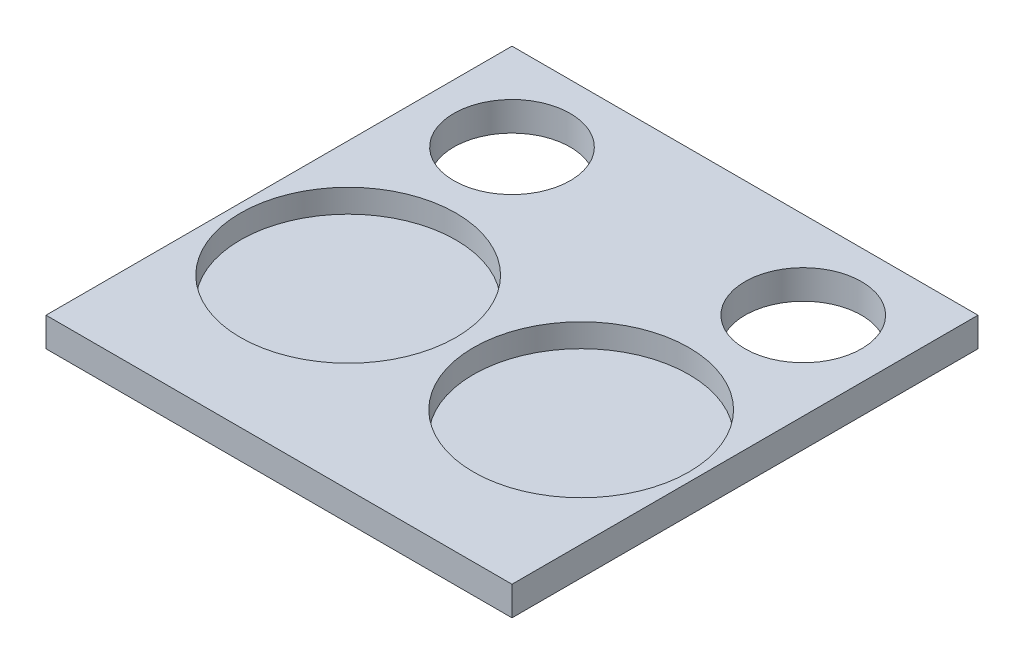
ISO-10303-21;
HEADER;
FILE_DESCRIPTION(('STEP AP214'),'2;1');
FILE_NAME('part.step','',(''),(''),'','','');
FILE_SCHEMA(('AUTOMOTIVE_DESIGN { 1 0 10303 214 1 1 1 1 }'));
ENDSEC;
DATA;
#1=APPLICATION_CONTEXT('core data for automotive mechanical design processes');
#2=APPLICATION_PROTOCOL_DEFINITION('international standard','automotive_design',2000,#1);
#3=PRODUCT_CONTEXT('',#1,'mechanical');
#4=PRODUCT('Part','Part','',(#3));
#5=PRODUCT_RELATED_PRODUCT_CATEGORY('part','',(#4));
#6=PRODUCT_DEFINITION_FORMATION('','',#4);
#7=PRODUCT_DEFINITION_CONTEXT('part definition',#1,'design');
#8=PRODUCT_DEFINITION('design','',#6,#7);
#9=PRODUCT_DEFINITION_SHAPE('','',#8);
#10=(LENGTH_UNIT() NAMED_UNIT(*) SI_UNIT(.MILLI.,.METRE.));
#11=(NAMED_UNIT(*) PLANE_ANGLE_UNIT() SI_UNIT($,.RADIAN.));
#12=(NAMED_UNIT(*) SI_UNIT($,.STERADIAN.) SOLID_ANGLE_UNIT());
#13=UNCERTAINTY_MEASURE_WITH_UNIT(LENGTH_MEASURE(1.E-05),#10,'distance_accuracy_value','');
#14=(GEOMETRIC_REPRESENTATION_CONTEXT(3) GLOBAL_UNCERTAINTY_ASSIGNED_CONTEXT((#13)) GLOBAL_UNIT_ASSIGNED_CONTEXT((#10,
#11,#12)) REPRESENTATION_CONTEXT('',''));
#15=CARTESIAN_POINT('',(0.,0.,0.));
#16=DIRECTION('',(0.,0.,1.));
#17=DIRECTION('',(1.,0.,0.));
#18=AXIS2_PLACEMENT_3D('',#15,#16,#17);
#19=CARTESIAN_POINT('',(0.,3.175,0.));
#20=DIRECTION('',(0.,-1.,0.));
#21=DIRECTION('',(0.,0.,-1.));
#22=AXIS2_PLACEMENT_3D('',#19,#20,#21);
#23=PLANE('',#22);
#24=CARTESIAN_POINT('',(-25.4,3.175,10.3184504706318));
#25=DIRECTION('',(0.,1.,0.));
#26=DIRECTION('',(0.,0.,1.));
#27=AXIS2_PLACEMENT_3D('',#24,#25,#26);
#28=CIRCLE('',#27,23.495);
#29=CARTESIAN_POINT('',(-25.4,3.175,33.8134504706318));
#30=VERTEX_POINT('',#29);
#31=EDGE_CURVE('E130',#30,#30,#28,.T.);
#32=ORIENTED_EDGE('',*,*,#31,.F.);
#33=EDGE_LOOP('',(#32));
#34=FACE_BOUND('',#33,.T.);
#35=CARTESIAN_POINT('',(25.4,3.175,10.3184504706318));
#36=DIRECTION('',(0.,1.,0.));
#37=DIRECTION('',(0.,0.,1.));
#38=AXIS2_PLACEMENT_3D('',#35,#36,#37);
#39=CIRCLE('',#38,23.495);
#40=CARTESIAN_POINT('',(25.4,3.175,33.8134504706318));
#41=VERTEX_POINT('',#40);
#42=EDGE_CURVE('E124',#41,#41,#39,.T.);
#43=ORIENTED_EDGE('',*,*,#42,.F.);
#44=EDGE_LOOP('',(#43));
#45=FACE_BOUND('',#44,.T.);
#46=DIRECTION('',(0.,0.,-1.));
#47=VECTOR('',#46,1.);
#48=CARTESIAN_POINT('',(50.8,3.175,50.8));
#49=LINE('',#48,#47);
#50=CARTESIAN_POINT('',(50.8,3.175,50.8));
#51=VERTEX_POINT('',#50);
#52=CARTESIAN_POINT('',(50.8,3.175,-50.8));
#53=VERTEX_POINT('',#52);
#54=EDGE_CURVE('E85',#51,#53,#49,.T.);
#55=ORIENTED_EDGE('',*,*,#54,.T.);
#56=DIRECTION('',(-1.,0.,0.));
#57=VECTOR('',#56,1.);
#58=CARTESIAN_POINT('',(-50.8,3.175,-50.8));
#59=LINE('',#58,#57);
#60=CARTESIAN_POINT('',(-50.8,3.175,-50.8));
#61=VERTEX_POINT('',#60);
#62=EDGE_CURVE('E80',#53,#61,#59,.T.);
#63=ORIENTED_EDGE('',*,*,#62,.T.);
#64=DIRECTION('',(0.,0.,1.));
#65=VECTOR('',#64,1.);
#66=CARTESIAN_POINT('',(-50.8,3.175,50.8));
#67=LINE('',#66,#65);
#68=CARTESIAN_POINT('',(-50.8,3.175,50.8));
#69=VERTEX_POINT('',#68);
#70=EDGE_CURVE('E83',#61,#69,#67,.T.);
#71=ORIENTED_EDGE('',*,*,#70,.T.);
#72=DIRECTION('',(1.,0.,0.));
#73=VECTOR('',#72,1.);
#74=CARTESIAN_POINT('',(-50.8,3.175,50.8));
#75=LINE('',#74,#73);
#76=EDGE_CURVE('E50',#69,#51,#75,.T.);
#77=ORIENTED_EDGE('',*,*,#76,.T.);
#78=EDGE_LOOP('',(#55,#63,#71,#77));
#79=FACE_BOUND('',#78,.T.);
#80=CARTESIAN_POINT('',(-31.75,3.175,-31.75));
#81=DIRECTION('',(0.,1.,0.));
#82=DIRECTION('',(0.,0.,1.));
#83=AXIS2_PLACEMENT_3D('',#80,#81,#82);
#84=CIRCLE('',#83,12.7);
#85=CARTESIAN_POINT('',(-31.75,3.175,-19.05));
#86=VERTEX_POINT('',#85);
#87=EDGE_CURVE('E100',#86,#86,#84,.T.);
#88=ORIENTED_EDGE('',*,*,#87,.F.);
#89=EDGE_LOOP('',(#88));
#90=FACE_BOUND('',#89,.T.);
#91=CARTESIAN_POINT('',(31.75,3.175,-31.75));
#92=DIRECTION('',(0.,1.,0.));
#93=DIRECTION('',(0.,0.,1.));
#94=AXIS2_PLACEMENT_3D('',#91,#92,#93);
#95=CIRCLE('',#94,12.7);
#96=CARTESIAN_POINT('',(31.75,3.175,-19.05));
#97=VERTEX_POINT('',#96);
#98=EDGE_CURVE('E115',#97,#97,#95,.T.);
#99=ORIENTED_EDGE('',*,*,#98,.F.);
#100=EDGE_LOOP('',(#99));
#101=FACE_BOUND('',#100,.T.);
#102=ADVANCED_FACE('F33',(#34,#45,#79,#90,#101),#23,.F.);
#103=CARTESIAN_POINT('',(0.,-3.175,0.));
#104=DIRECTION('',(0.,-1.,0.));
#105=DIRECTION('',(0.,0.,-1.));
#106=AXIS2_PLACEMENT_3D('',#103,#104,#105);
#107=PLANE('',#106);
#108=CARTESIAN_POINT('',(-31.75,-3.175,-31.75));
#109=DIRECTION('',(0.,1.,0.));
#110=DIRECTION('',(0.,0.,1.));
#111=AXIS2_PLACEMENT_3D('',#108,#109,#110);
#112=CIRCLE('',#111,12.7);
#113=CARTESIAN_POINT('',(-31.75,-3.175,-19.05));
#114=VERTEX_POINT('',#113);
#115=EDGE_CURVE('E112',#114,#114,#112,.T.);
#116=ORIENTED_EDGE('',*,*,#115,.T.);
#117=EDGE_LOOP('',(#116));
#118=FACE_BOUND('',#117,.T.);
#119=DIRECTION('',(0.,0.,-1.));
#120=VECTOR('',#119,1.);
#121=CARTESIAN_POINT('',(50.8,-3.175,50.8));
#122=LINE('',#121,#120);
#123=CARTESIAN_POINT('',(50.8,-3.175,50.8));
#124=VERTEX_POINT('',#123);
#125=CARTESIAN_POINT('',(50.8,-3.175,-50.8));
#126=VERTEX_POINT('',#125);
#127=EDGE_CURVE('E97',#124,#126,#122,.T.);
#128=ORIENTED_EDGE('',*,*,#127,.F.);
#129=DIRECTION('',(1.,0.,0.));
#130=VECTOR('',#129,1.);
#131=CARTESIAN_POINT('',(-50.8,-3.175,50.8));
#132=LINE('',#131,#130);
#133=CARTESIAN_POINT('',(-50.8,-3.175,50.8));
#134=VERTEX_POINT('',#133);
#135=EDGE_CURVE('E73',#134,#124,#132,.T.);
#136=ORIENTED_EDGE('',*,*,#135,.F.);
#137=DIRECTION('',(0.,0.,1.));
#138=VECTOR('',#137,1.);
#139=CARTESIAN_POINT('',(-50.8,-3.175,50.8));
#140=LINE('',#139,#138);
#141=CARTESIAN_POINT('',(-50.8,-3.175,-50.8));
#142=VERTEX_POINT('',#141);
#143=EDGE_CURVE('E67',#142,#134,#140,.T.);
#144=ORIENTED_EDGE('',*,*,#143,.F.);
#145=DIRECTION('',(-1.,0.,0.));
#146=VECTOR('',#145,1.);
#147=CARTESIAN_POINT('',(-50.8,-3.175,-50.8));
#148=LINE('',#147,#146);
#149=EDGE_CURVE('E89',#126,#142,#148,.T.);
#150=ORIENTED_EDGE('',*,*,#149,.F.);
#151=EDGE_LOOP('',(#128,#136,#144,#150));
#152=FACE_BOUND('',#151,.T.);
#153=CARTESIAN_POINT('',(31.75,-3.175,-31.75));
#154=DIRECTION('',(0.,1.,0.));
#155=DIRECTION('',(0.,0.,1.));
#156=AXIS2_PLACEMENT_3D('',#153,#154,#155);
#157=CIRCLE('',#156,12.7);
#158=CARTESIAN_POINT('',(31.75,-3.175,-19.05));
#159=VERTEX_POINT('',#158);
#160=EDGE_CURVE('E118',#159,#159,#157,.T.);
#161=ORIENTED_EDGE('',*,*,#160,.T.);
#162=EDGE_LOOP('',(#161));
#163=FACE_BOUND('',#162,.T.);
#164=ADVANCED_FACE('F108',(#118,#152,#163),#107,.T.);
#165=CARTESIAN_POINT('',(50.8,3.175,50.8));
#166=DIRECTION('',(-1.,0.,0.));
#167=DIRECTION('',(0.,0.,1.));
#168=AXIS2_PLACEMENT_3D('',#165,#166,#167);
#169=PLANE('',#168);
#170=ORIENTED_EDGE('',*,*,#127,.T.);
#171=DIRECTION('',(0.,-1.,0.));
#172=VECTOR('',#171,1.);
#173=CARTESIAN_POINT('',(50.8,3.175,-50.8));
#174=LINE('',#173,#172);
#175=EDGE_CURVE('E11',#53,#126,#174,.T.);
#176=ORIENTED_EDGE('',*,*,#175,.F.);
#177=ORIENTED_EDGE('',*,*,#54,.F.);
#178=DIRECTION('',(0.,-1.,0.));
#179=VECTOR('',#178,1.);
#180=CARTESIAN_POINT('',(50.8,3.175,50.8));
#181=LINE('',#180,#179);
#182=EDGE_CURVE('E93',#51,#124,#181,.T.);
#183=ORIENTED_EDGE('',*,*,#182,.T.);
#184=EDGE_LOOP('',(#170,#176,#177,#183));
#185=FACE_BOUND('',#184,.T.);
#186=ADVANCED_FACE('F35',(#185),#169,.F.);
#187=CARTESIAN_POINT('',(-50.8,3.175,-50.8));
#188=DIRECTION('',(0.,0.,1.));
#189=DIRECTION('',(1.,0.,0.));
#190=AXIS2_PLACEMENT_3D('',#187,#188,#189);
#191=PLANE('',#190);
#192=ORIENTED_EDGE('',*,*,#149,.T.);
#193=DIRECTION('',(0.,-1.,0.));
#194=VECTOR('',#193,1.);
#195=CARTESIAN_POINT('',(-50.8,3.175,-50.8));
#196=LINE('',#195,#194);
#197=EDGE_CURVE('E42',#61,#142,#196,.T.);
#198=ORIENTED_EDGE('',*,*,#197,.F.);
#199=ORIENTED_EDGE('',*,*,#62,.F.);
#200=ORIENTED_EDGE('',*,*,#175,.T.);
#201=EDGE_LOOP('',(#192,#198,#199,#200));
#202=FACE_BOUND('',#201,.T.);
#203=ADVANCED_FACE('F88',(#202),#191,.F.);
#204=CARTESIAN_POINT('',(-50.8,3.175,50.8));
#205=DIRECTION('',(1.,0.,0.));
#206=DIRECTION('',(0.,0.,-1.));
#207=AXIS2_PLACEMENT_3D('',#204,#205,#206);
#208=PLANE('',#207);
#209=ORIENTED_EDGE('',*,*,#143,.T.);
#210=DIRECTION('',(0.,-1.,0.));
#211=VECTOR('',#210,1.);
#212=CARTESIAN_POINT('',(-50.8,3.175,50.8));
#213=LINE('',#212,#211);
#214=EDGE_CURVE('E90',#69,#134,#213,.T.);
#215=ORIENTED_EDGE('',*,*,#214,.F.);
#216=ORIENTED_EDGE('',*,*,#70,.F.);
#217=ORIENTED_EDGE('',*,*,#197,.T.);
#218=EDGE_LOOP('',(#209,#215,#216,#217));
#219=FACE_BOUND('',#218,.T.);
#220=ADVANCED_FACE('F91',(#219),#208,.F.);
#221=CARTESIAN_POINT('',(-50.8,3.175,50.8));
#222=DIRECTION('',(0.,0.,-1.));
#223=DIRECTION('',(-1.,0.,0.));
#224=AXIS2_PLACEMENT_3D('',#221,#222,#223);
#225=PLANE('',#224);
#226=ORIENTED_EDGE('',*,*,#135,.T.);
#227=ORIENTED_EDGE('',*,*,#182,.F.);
#228=ORIENTED_EDGE('',*,*,#76,.F.);
#229=ORIENTED_EDGE('',*,*,#214,.T.);
#230=EDGE_LOOP('',(#226,#227,#228,#229));
#231=FACE_BOUND('',#230,.T.);
#232=ADVANCED_FACE('F105',(#231),#225,.F.);
#233=CARTESIAN_POINT('',(-31.75,3.175,-31.75));
#234=DIRECTION('',(0.,-1.,0.));
#235=DIRECTION('',(0.,0.,-1.));
#236=AXIS2_PLACEMENT_3D('',#233,#234,#235);
#237=CYLINDRICAL_SURFACE('',#236,12.7);
#238=ORIENTED_EDGE('',*,*,#87,.T.);
#239=EDGE_LOOP('',(#238));
#240=FACE_BOUND('',#239,.T.);
#241=ORIENTED_EDGE('',*,*,#115,.F.);
#242=EDGE_LOOP('',(#241));
#243=FACE_BOUND('',#242,.T.);
#244=ADVANCED_FACE('F161',(#240,#243),#237,.F.);
#245=CARTESIAN_POINT('',(31.75,3.175,-31.75));
#246=DIRECTION('',(0.,-1.,0.));
#247=DIRECTION('',(0.,0.,-1.));
#248=AXIS2_PLACEMENT_3D('',#245,#246,#247);
#249=CYLINDRICAL_SURFACE('',#248,12.7);
#250=ORIENTED_EDGE('',*,*,#98,.T.);
#251=EDGE_LOOP('',(#250));
#252=FACE_BOUND('',#251,.T.);
#253=ORIENTED_EDGE('',*,*,#160,.F.);
#254=EDGE_LOOP('',(#253));
#255=FACE_BOUND('',#254,.T.);
#256=ADVANCED_FACE('F152',(#252,#255),#249,.F.);
#257=CARTESIAN_POINT('',(25.4,-1.905,10.3184504706318));
#258=DIRECTION('',(0.,1.,0.));
#259=DIRECTION('',(0.,0.,1.));
#260=AXIS2_PLACEMENT_3D('',#257,#258,#259);
#261=CYLINDRICAL_SURFACE('',#260,23.495);
#262=CARTESIAN_POINT('',(25.4,-1.905,10.3184504706318));
#263=DIRECTION('',(0.,1.,0.));
#264=DIRECTION('',(0.,0.,1.));
#265=AXIS2_PLACEMENT_3D('',#262,#263,#264);
#266=CIRCLE('',#265,23.495);
#267=CARTESIAN_POINT('',(25.4,-1.905,33.8134504706318));
#268=VERTEX_POINT('',#267);
#269=EDGE_CURVE('E127',#268,#268,#266,.T.);
#270=ORIENTED_EDGE('',*,*,#269,.F.);
#271=EDGE_LOOP('',(#270));
#272=FACE_BOUND('',#271,.T.);
#273=ORIENTED_EDGE('',*,*,#42,.T.);
#274=EDGE_LOOP('',(#273));
#275=FACE_BOUND('',#274,.T.);
#276=ADVANCED_FACE('F150',(#272,#275),#261,.F.);
#277=CARTESIAN_POINT('',(25.4,-1.905,10.3184504706318));
#278=DIRECTION('',(0.,1.,0.));
#279=DIRECTION('',(0.,0.,1.));
#280=AXIS2_PLACEMENT_3D('',#277,#278,#279);
#281=PLANE('',#280);
#282=ORIENTED_EDGE('',*,*,#269,.T.);
#283=EDGE_LOOP('',(#282));
#284=FACE_BOUND('',#283,.T.);
#285=ADVANCED_FACE('F141',(#284),#281,.T.);
#286=CARTESIAN_POINT('',(-25.4,-1.905,10.3184504706318));
#287=DIRECTION('',(0.,1.,0.));
#288=DIRECTION('',(0.,0.,1.));
#289=AXIS2_PLACEMENT_3D('',#286,#287,#288);
#290=CYLINDRICAL_SURFACE('',#289,23.495);
#291=CARTESIAN_POINT('',(-25.4,-1.905,10.3184504706318));
#292=DIRECTION('',(0.,1.,0.));
#293=DIRECTION('',(0.,0.,1.));
#294=AXIS2_PLACEMENT_3D('',#291,#292,#293);
#295=CIRCLE('',#294,23.495);
#296=CARTESIAN_POINT('',(-25.4,-1.905,33.8134504706318));
#297=VERTEX_POINT('',#296);
#298=EDGE_CURVE('E121',#297,#297,#295,.T.);
#299=ORIENTED_EDGE('',*,*,#298,.F.);
#300=EDGE_LOOP('',(#299));
#301=FACE_BOUND('',#300,.T.);
#302=ORIENTED_EDGE('',*,*,#31,.T.);
#303=EDGE_LOOP('',(#302));
#304=FACE_BOUND('',#303,.T.);
#305=ADVANCED_FACE('F138',(#301,#304),#290,.F.);
#306=CARTESIAN_POINT('',(-25.4,-1.905,10.3184504706318));
#307=DIRECTION('',(0.,1.,0.));
#308=DIRECTION('',(0.,0.,1.));
#309=AXIS2_PLACEMENT_3D('',#306,#307,#308);
#310=PLANE('',#309);
#311=ORIENTED_EDGE('',*,*,#298,.T.);
#312=EDGE_LOOP('',(#311));
#313=FACE_BOUND('',#312,.T.);
#314=ADVANCED_FACE('F136',(#313),#310,.T.);
#315=CLOSED_SHELL('',(#102,#164,#186,#203,#220,#232,#244,#256,#276,#285,#305,#314));
#316=MANIFOLD_SOLID_BREP('B2',#315);
#317=ADVANCED_BREP_SHAPE_REPRESENTATION('',(#18,#316),#14);
#318=SHAPE_DEFINITION_REPRESENTATION(#9,#317);
ENDSEC;
END-ISO-10303-21;
